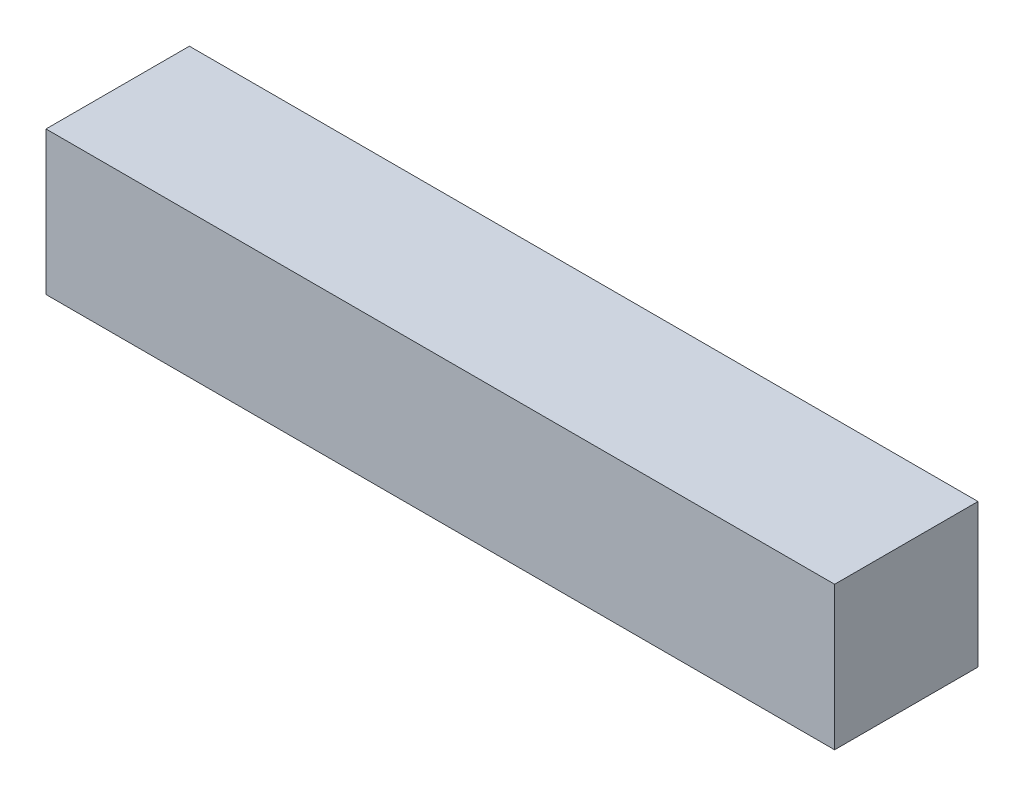
ISO-10303-21;
HEADER;
FILE_DESCRIPTION(('STEP AP214'),'2;1');
FILE_NAME('part.step','',(''),(''),'','','');
FILE_SCHEMA(('AUTOMOTIVE_DESIGN { 1 0 10303 214 1 1 1 1 }'));
ENDSEC;
DATA;
#1=APPLICATION_CONTEXT('core data for automotive mechanical design processes');
#2=APPLICATION_PROTOCOL_DEFINITION('international standard','automotive_design',2000,#1);
#3=PRODUCT_CONTEXT('',#1,'mechanical');
#4=PRODUCT('Part','Part','',(#3));
#5=PRODUCT_RELATED_PRODUCT_CATEGORY('part','',(#4));
#6=PRODUCT_DEFINITION_FORMATION('','',#4);
#7=PRODUCT_DEFINITION_CONTEXT('part definition',#1,'design');
#8=PRODUCT_DEFINITION('design','',#6,#7);
#9=PRODUCT_DEFINITION_SHAPE('','',#8);
#10=(LENGTH_UNIT() NAMED_UNIT(*) SI_UNIT(.MILLI.,.METRE.));
#11=(NAMED_UNIT(*) PLANE_ANGLE_UNIT() SI_UNIT($,.RADIAN.));
#12=(NAMED_UNIT(*) SI_UNIT($,.STERADIAN.) SOLID_ANGLE_UNIT());
#13=UNCERTAINTY_MEASURE_WITH_UNIT(LENGTH_MEASURE(1.E-05),#10,'distance_accuracy_value','');
#14=(GEOMETRIC_REPRESENTATION_CONTEXT(3) GLOBAL_UNCERTAINTY_ASSIGNED_CONTEXT((#13)) GLOBAL_UNIT_ASSIGNED_CONTEXT((#10,
#11,#12)) REPRESENTATION_CONTEXT('',''));
#15=CARTESIAN_POINT('',(0.,0.,0.));
#16=DIRECTION('',(0.,0.,1.));
#17=DIRECTION('',(1.,0.,0.));
#18=AXIS2_PLACEMENT_3D('',#15,#16,#17);
#19=CARTESIAN_POINT('',(0.,0.,3.175));
#20=DIRECTION('',(1.,0.,0.));
#21=DIRECTION('',(0.,0.,-1.));
#22=AXIS2_PLACEMENT_3D('',#19,#20,#21);
#23=PLANE('',#22);
#24=DIRECTION('',(0.,-1.,0.));
#25=VECTOR('',#24,1.);
#26=CARTESIAN_POINT('',(0.,0.,0.));
#27=LINE('',#26,#25);
#28=CARTESIAN_POINT('',(0.,3.175,0.));
#29=VERTEX_POINT('',#28);
#30=CARTESIAN_POINT('',(0.,0.,0.));
#31=VERTEX_POINT('',#30);
#32=EDGE_CURVE('E96',#29,#31,#27,.T.);
#33=ORIENTED_EDGE('',*,*,#32,.T.);
#34=DIRECTION('',(0.,0.,-1.));
#35=VECTOR('',#34,1.);
#36=CARTESIAN_POINT('',(0.,0.,3.175));
#37=LINE('',#36,#35);
#38=CARTESIAN_POINT('',(0.,0.,3.175));
#39=VERTEX_POINT('',#38);
#40=EDGE_CURVE('E11',#39,#31,#37,.T.);
#41=ORIENTED_EDGE('',*,*,#40,.F.);
#42=DIRECTION('',(0.,-1.,0.));
#43=VECTOR('',#42,1.);
#44=CARTESIAN_POINT('',(0.,0.,3.175));
#45=LINE('',#44,#43);
#46=CARTESIAN_POINT('',(0.,3.175,3.175));
#47=VERTEX_POINT('',#46);
#48=EDGE_CURVE('E84',#47,#39,#45,.T.);
#49=ORIENTED_EDGE('',*,*,#48,.F.);
#50=DIRECTION('',(0.,0.,-1.));
#51=VECTOR('',#50,1.);
#52=CARTESIAN_POINT('',(0.,3.175,3.175));
#53=LINE('',#52,#51);
#54=EDGE_CURVE('E92',#47,#29,#53,.T.);
#55=ORIENTED_EDGE('',*,*,#54,.T.);
#56=EDGE_LOOP('',(#33,#41,#49,#55));
#57=FACE_BOUND('',#56,.T.);
#58=ADVANCED_FACE('F33',(#57),#23,.F.);
#59=CARTESIAN_POINT('',(0.,0.,3.175));
#60=DIRECTION('',(0.,1.,0.));
#61=DIRECTION('',(0.,0.,1.));
#62=AXIS2_PLACEMENT_3D('',#59,#60,#61);
#63=PLANE('',#62);
#64=DIRECTION('',(1.,0.,0.));
#65=VECTOR('',#64,1.);
#66=CARTESIAN_POINT('',(0.,0.,0.));
#67=LINE('',#66,#65);
#68=CARTESIAN_POINT('',(17.4625,0.,0.));
#69=VERTEX_POINT('',#68);
#70=EDGE_CURVE('E88',#31,#69,#67,.T.);
#71=ORIENTED_EDGE('',*,*,#70,.T.);
#72=DIRECTION('',(0.,0.,-1.));
#73=VECTOR('',#72,1.);
#74=CARTESIAN_POINT('',(17.4625,0.,3.175));
#75=LINE('',#74,#73);
#76=CARTESIAN_POINT('',(17.4625,0.,3.175));
#77=VERTEX_POINT('',#76);
#78=EDGE_CURVE('E41',#77,#69,#75,.T.);
#79=ORIENTED_EDGE('',*,*,#78,.F.);
#80=DIRECTION('',(1.,0.,0.));
#81=VECTOR('',#80,1.);
#82=CARTESIAN_POINT('',(0.,0.,3.175));
#83=LINE('',#82,#81);
#84=EDGE_CURVE('E79',#39,#77,#83,.T.);
#85=ORIENTED_EDGE('',*,*,#84,.F.);
#86=ORIENTED_EDGE('',*,*,#40,.T.);
#87=EDGE_LOOP('',(#71,#79,#85,#86));
#88=FACE_BOUND('',#87,.T.);
#89=ADVANCED_FACE('F87',(#88),#63,.F.);
#90=CARTESIAN_POINT('',(17.4625,0.,3.175));
#91=DIRECTION('',(-1.,0.,0.));
#92=DIRECTION('',(0.,0.,1.));
#93=AXIS2_PLACEMENT_3D('',#90,#91,#92);
#94=PLANE('',#93);
#95=DIRECTION('',(0.,1.,0.));
#96=VECTOR('',#95,1.);
#97=CARTESIAN_POINT('',(17.4625,0.,0.));
#98=LINE('',#97,#96);
#99=CARTESIAN_POINT('',(17.4625,3.175,0.));
#100=VERTEX_POINT('',#99);
#101=EDGE_CURVE('E66',#69,#100,#98,.T.);
#102=ORIENTED_EDGE('',*,*,#101,.T.);
#103=DIRECTION('',(0.,0.,-1.));
#104=VECTOR('',#103,1.);
#105=CARTESIAN_POINT('',(17.4625,3.175,3.175));
#106=LINE('',#105,#104);
#107=CARTESIAN_POINT('',(17.4625,3.175,3.175));
#108=VERTEX_POINT('',#107);
#109=EDGE_CURVE('E89',#108,#100,#106,.T.);
#110=ORIENTED_EDGE('',*,*,#109,.F.);
#111=DIRECTION('',(0.,1.,0.));
#112=VECTOR('',#111,1.);
#113=CARTESIAN_POINT('',(17.4625,0.,3.175));
#114=LINE('',#113,#112);
#115=EDGE_CURVE('E82',#77,#108,#114,.T.);
#116=ORIENTED_EDGE('',*,*,#115,.F.);
#117=ORIENTED_EDGE('',*,*,#78,.T.);
#118=EDGE_LOOP('',(#102,#110,#116,#117));
#119=FACE_BOUND('',#118,.T.);
#120=ADVANCED_FACE('F90',(#119),#94,.F.);
#121=CARTESIAN_POINT('',(0.,3.175,3.175));
#122=DIRECTION('',(0.,-1.,0.));
#123=DIRECTION('',(0.,0.,-1.));
#124=AXIS2_PLACEMENT_3D('',#121,#122,#123);
#125=PLANE('',#124);
#126=DIRECTION('',(-1.,0.,0.));
#127=VECTOR('',#126,1.);
#128=CARTESIAN_POINT('',(0.,3.175,0.));
#129=LINE('',#128,#127);
#130=EDGE_CURVE('E72',#100,#29,#129,.T.);
#131=ORIENTED_EDGE('',*,*,#130,.T.);
#132=ORIENTED_EDGE('',*,*,#54,.F.);
#133=DIRECTION('',(-1.,0.,0.));
#134=VECTOR('',#133,1.);
#135=CARTESIAN_POINT('',(0.,3.175,3.175));
#136=LINE('',#135,#134);
#137=EDGE_CURVE('E49',#108,#47,#136,.T.);
#138=ORIENTED_EDGE('',*,*,#137,.F.);
#139=ORIENTED_EDGE('',*,*,#109,.T.);
#140=EDGE_LOOP('',(#131,#132,#138,#139));
#141=FACE_BOUND('',#140,.T.);
#142=ADVANCED_FACE('F103',(#141),#125,.F.);
#143=CARTESIAN_POINT('',(0.,0.,3.175));
#144=DIRECTION('',(0.,0.,-1.));
#145=DIRECTION('',(-1.,0.,0.));
#146=AXIS2_PLACEMENT_3D('',#143,#144,#145);
#147=PLANE('',#146);
#148=ORIENTED_EDGE('',*,*,#48,.T.);
#149=ORIENTED_EDGE('',*,*,#84,.T.);
#150=ORIENTED_EDGE('',*,*,#115,.T.);
#151=ORIENTED_EDGE('',*,*,#137,.T.);
#152=EDGE_LOOP('',(#148,#149,#150,#151));
#153=FACE_BOUND('',#152,.T.);
#154=ADVANCED_FACE('F80',(#153),#147,.F.);
#155=CARTESIAN_POINT('',(0.,0.,0.));
#156=DIRECTION('',(0.,0.,-1.));
#157=DIRECTION('',(-1.,0.,0.));
#158=AXIS2_PLACEMENT_3D('',#155,#156,#157);
#159=PLANE('',#158);
#160=ORIENTED_EDGE('',*,*,#32,.F.);
#161=ORIENTED_EDGE('',*,*,#130,.F.);
#162=ORIENTED_EDGE('',*,*,#101,.F.);
#163=ORIENTED_EDGE('',*,*,#70,.F.);
#164=EDGE_LOOP('',(#160,#161,#162,#163));
#165=FACE_BOUND('',#164,.T.);
#166=ADVANCED_FACE('F106',(#165),#159,.T.);
#167=CLOSED_SHELL('',(#58,#89,#120,#142,#154,#166));
#168=MANIFOLD_SOLID_BREP('B2',#167);
#169=ADVANCED_BREP_SHAPE_REPRESENTATION('',(#18,#168),#14);
#170=SHAPE_DEFINITION_REPRESENTATION(#9,#169);
ENDSEC;
END-ISO-10303-21;
